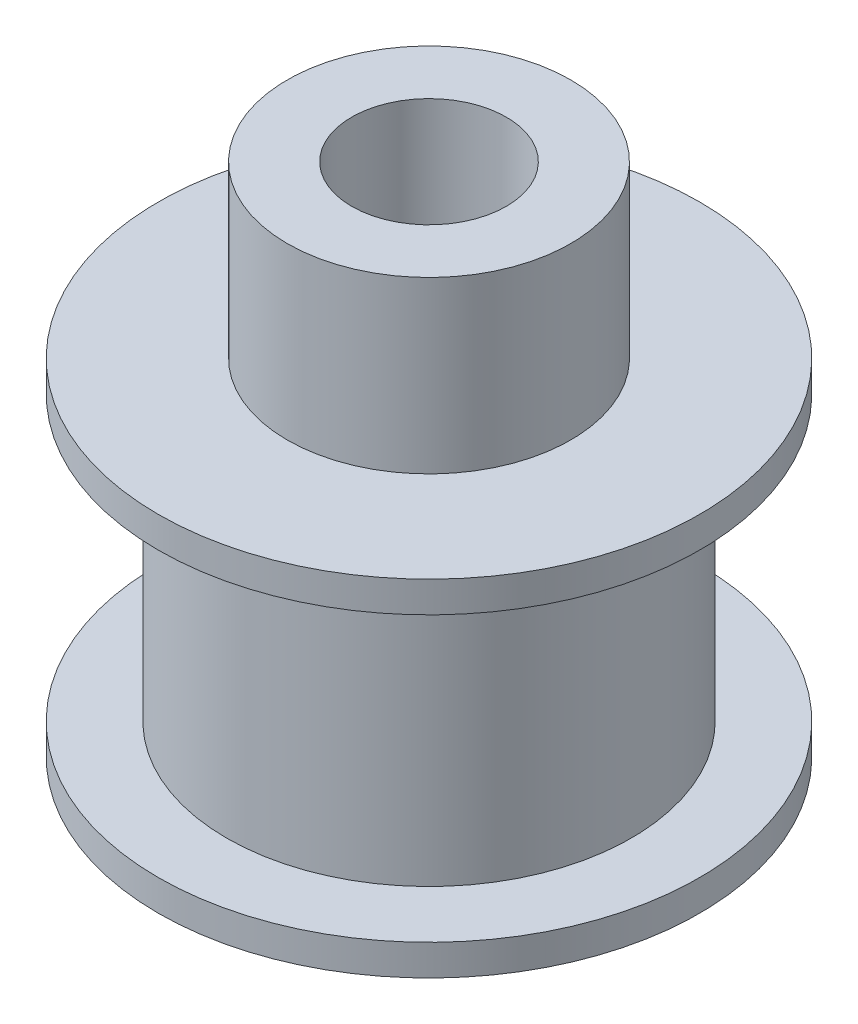
ISO-10303-21;
HEADER;
FILE_DESCRIPTION(('STEP AP214'),'2;1');
FILE_NAME('part.step','',(''),(''),'','','');
FILE_SCHEMA(('AUTOMOTIVE_DESIGN { 1 0 10303 214 1 1 1 1 }'));
ENDSEC;
DATA;
#1=APPLICATION_CONTEXT('core data for automotive mechanical design processes');
#2=APPLICATION_PROTOCOL_DEFINITION('international standard','automotive_design',2000,#1);
#3=PRODUCT_CONTEXT('',#1,'mechanical');
#4=PRODUCT('Part','Part','',(#3));
#5=PRODUCT_RELATED_PRODUCT_CATEGORY('part','',(#4));
#6=PRODUCT_DEFINITION_FORMATION('','',#4);
#7=PRODUCT_DEFINITION_CONTEXT('part definition',#1,'design');
#8=PRODUCT_DEFINITION('design','',#6,#7);
#9=PRODUCT_DEFINITION_SHAPE('','',#8);
#10=(LENGTH_UNIT() NAMED_UNIT(*) SI_UNIT(.MILLI.,.METRE.));
#11=(NAMED_UNIT(*) PLANE_ANGLE_UNIT() SI_UNIT($,.RADIAN.));
#12=(NAMED_UNIT(*) SI_UNIT($,.STERADIAN.) SOLID_ANGLE_UNIT());
#13=UNCERTAINTY_MEASURE_WITH_UNIT(LENGTH_MEASURE(1.E-05),#10,'distance_accuracy_value','');
#14=(GEOMETRIC_REPRESENTATION_CONTEXT(3) GLOBAL_UNCERTAINTY_ASSIGNED_CONTEXT((#13)) GLOBAL_UNIT_ASSIGNED_CONTEXT((#10,
#11,#12)) REPRESENTATION_CONTEXT('',''));
#15=CARTESIAN_POINT('',(0.,0.,0.));
#16=DIRECTION('',(0.,0.,1.));
#17=DIRECTION('',(1.,0.,0.));
#18=AXIS2_PLACEMENT_3D('',#15,#16,#17);
#19=CARTESIAN_POINT('',(0.,1.2,0.));
#20=DIRECTION('',(0.,-1.,0.));
#21=DIRECTION('',(0.,0.,-1.));
#22=AXIS2_PLACEMENT_3D('',#19,#20,#21);
#23=CYLINDRICAL_SURFACE('',#22,10.5);
#24=CARTESIAN_POINT('',(0.,1.2,0.));
#25=DIRECTION('',(0.,1.,0.));
#26=DIRECTION('',(0.,0.,1.));
#27=AXIS2_PLACEMENT_3D('',#24,#25,#26);
#28=CIRCLE('',#27,10.5);
#29=CARTESIAN_POINT('',(0.,1.2,10.5));
#30=VERTEX_POINT('',#29);
#31=EDGE_CURVE('E10',#30,#30,#28,.T.);
#32=ORIENTED_EDGE('',*,*,#31,.F.);
#33=EDGE_LOOP('',(#32));
#34=FACE_BOUND('',#33,.T.);
#35=CARTESIAN_POINT('',(0.,0.,0.));
#36=DIRECTION('',(0.,1.,0.));
#37=DIRECTION('',(0.,0.,1.));
#38=AXIS2_PLACEMENT_3D('',#35,#36,#37);
#39=CIRCLE('',#38,10.5);
#40=CARTESIAN_POINT('',(0.,0.,10.5));
#41=VERTEX_POINT('',#40);
#42=EDGE_CURVE('E36',#41,#41,#39,.T.);
#43=ORIENTED_EDGE('',*,*,#42,.T.);
#44=EDGE_LOOP('',(#43));
#45=FACE_BOUND('',#44,.T.);
#46=ADVANCED_FACE('F33',(#34,#45),#23,.T.);
#47=CARTESIAN_POINT('',(0.,1.2,0.));
#48=DIRECTION('',(0.,1.,0.));
#49=DIRECTION('',(0.,0.,1.));
#50=AXIS2_PLACEMENT_3D('',#47,#48,#49);
#51=PLANE('',#50);
#52=CARTESIAN_POINT('',(0.,1.2,0.));
#53=DIRECTION('',(0.,1.,0.));
#54=DIRECTION('',(0.,0.,1.));
#55=AXIS2_PLACEMENT_3D('',#52,#53,#54);
#56=CIRCLE('',#55,7.85);
#57=CARTESIAN_POINT('',(0.,1.2,7.85));
#58=VERTEX_POINT('',#57);
#59=EDGE_CURVE('E45',#58,#58,#56,.T.);
#60=ORIENTED_EDGE('',*,*,#59,.F.);
#61=EDGE_LOOP('',(#60));
#62=FACE_BOUND('',#61,.T.);
#63=ORIENTED_EDGE('',*,*,#31,.T.);
#64=EDGE_LOOP('',(#63));
#65=FACE_BOUND('',#64,.T.);
#66=ADVANCED_FACE('F110',(#62,#65),#51,.T.);
#67=CARTESIAN_POINT('',(0.,0.,0.));
#68=DIRECTION('',(0.,1.,0.));
#69=DIRECTION('',(0.,0.,1.));
#70=AXIS2_PLACEMENT_3D('',#67,#68,#69);
#71=PLANE('',#70);
#72=CARTESIAN_POINT('',(0.,0.,0.));
#73=DIRECTION('',(0.,1.,0.));
#74=DIRECTION('',(0.,0.,1.));
#75=AXIS2_PLACEMENT_3D('',#72,#73,#74);
#76=CIRCLE('',#75,3.);
#77=CARTESIAN_POINT('',(0.,0.,3.));
#78=VERTEX_POINT('',#77);
#79=EDGE_CURVE('E60',#78,#78,#76,.T.);
#80=ORIENTED_EDGE('',*,*,#79,.T.);
#81=EDGE_LOOP('',(#80));
#82=FACE_BOUND('',#81,.T.);
#83=ORIENTED_EDGE('',*,*,#42,.F.);
#84=EDGE_LOOP('',(#83));
#85=FACE_BOUND('',#84,.T.);
#86=ADVANCED_FACE('F69',(#82,#85),#71,.F.);
#87=CARTESIAN_POINT('',(0.,12.2,0.));
#88=DIRECTION('',(0.,-1.,0.));
#89=DIRECTION('',(0.,0.,-1.));
#90=AXIS2_PLACEMENT_3D('',#87,#88,#89);
#91=CYLINDRICAL_SURFACE('',#90,7.85);
#92=CARTESIAN_POINT('',(0.,12.2,0.));
#93=DIRECTION('',(0.,1.,0.));
#94=DIRECTION('',(0.,0.,1.));
#95=AXIS2_PLACEMENT_3D('',#92,#93,#94);
#96=CIRCLE('',#95,7.85);
#97=CARTESIAN_POINT('',(0.,12.2,7.85));
#98=VERTEX_POINT('',#97);
#99=EDGE_CURVE('E43',#98,#98,#96,.T.);
#100=ORIENTED_EDGE('',*,*,#99,.F.);
#101=EDGE_LOOP('',(#100));
#102=FACE_BOUND('',#101,.T.);
#103=ORIENTED_EDGE('',*,*,#59,.T.);
#104=EDGE_LOOP('',(#103));
#105=FACE_BOUND('',#104,.T.);
#106=ADVANCED_FACE('F100',(#102,#105),#91,.T.);
#107=CARTESIAN_POINT('',(0.,13.4,0.));
#108=DIRECTION('',(0.,-1.,0.));
#109=DIRECTION('',(0.,0.,-1.));
#110=AXIS2_PLACEMENT_3D('',#107,#108,#109);
#111=CYLINDRICAL_SURFACE('',#110,10.5);
#112=CARTESIAN_POINT('',(0.,13.4,0.));
#113=DIRECTION('',(0.,1.,0.));
#114=DIRECTION('',(0.,0.,1.));
#115=AXIS2_PLACEMENT_3D('',#112,#113,#114);
#116=CIRCLE('',#115,10.5);
#117=CARTESIAN_POINT('',(0.,13.4,10.5));
#118=VERTEX_POINT('',#117);
#119=EDGE_CURVE('E48',#118,#118,#116,.T.);
#120=ORIENTED_EDGE('',*,*,#119,.F.);
#121=EDGE_LOOP('',(#120));
#122=FACE_BOUND('',#121,.T.);
#123=CARTESIAN_POINT('',(0.,12.2,0.));
#124=DIRECTION('',(0.,1.,0.));
#125=DIRECTION('',(0.,0.,1.));
#126=AXIS2_PLACEMENT_3D('',#123,#124,#125);
#127=CIRCLE('',#126,10.5);
#128=CARTESIAN_POINT('',(0.,12.2,10.5));
#129=VERTEX_POINT('',#128);
#130=EDGE_CURVE('E51',#129,#129,#127,.T.);
#131=ORIENTED_EDGE('',*,*,#130,.T.);
#132=EDGE_LOOP('',(#131));
#133=FACE_BOUND('',#132,.T.);
#134=ADVANCED_FACE('F94',(#122,#133),#111,.T.);
#135=CARTESIAN_POINT('',(0.,13.4,0.));
#136=DIRECTION('',(0.,1.,0.));
#137=DIRECTION('',(0.,0.,1.));
#138=AXIS2_PLACEMENT_3D('',#135,#136,#137);
#139=PLANE('',#138);
#140=CARTESIAN_POINT('',(0.,13.4,0.));
#141=DIRECTION('',(0.,1.,0.));
#142=DIRECTION('',(0.,0.,1.));
#143=AXIS2_PLACEMENT_3D('',#140,#141,#142);
#144=CIRCLE('',#143,5.5);
#145=CARTESIAN_POINT('',(0.,13.4,5.5));
#146=VERTEX_POINT('',#145);
#147=EDGE_CURVE('E57',#146,#146,#144,.T.);
#148=ORIENTED_EDGE('',*,*,#147,.F.);
#149=EDGE_LOOP('',(#148));
#150=FACE_BOUND('',#149,.T.);
#151=ORIENTED_EDGE('',*,*,#119,.T.);
#152=EDGE_LOOP('',(#151));
#153=FACE_BOUND('',#152,.T.);
#154=ADVANCED_FACE('F91',(#150,#153),#139,.T.);
#155=CARTESIAN_POINT('',(0.,12.2,0.));
#156=DIRECTION('',(0.,1.,0.));
#157=DIRECTION('',(0.,0.,1.));
#158=AXIS2_PLACEMENT_3D('',#155,#156,#157);
#159=PLANE('',#158);
#160=ORIENTED_EDGE('',*,*,#99,.T.);
#161=EDGE_LOOP('',(#160));
#162=FACE_BOUND('',#161,.T.);
#163=ORIENTED_EDGE('',*,*,#130,.F.);
#164=EDGE_LOOP('',(#163));
#165=FACE_BOUND('',#164,.T.);
#166=ADVANCED_FACE('F87',(#162,#165),#159,.F.);
#167=CARTESIAN_POINT('',(0.,20.,0.));
#168=DIRECTION('',(0.,-1.,0.));
#169=DIRECTION('',(0.,0.,-1.));
#170=AXIS2_PLACEMENT_3D('',#167,#168,#169);
#171=CYLINDRICAL_SURFACE('',#170,5.5);
#172=CARTESIAN_POINT('',(0.,20.,0.));
#173=DIRECTION('',(0.,1.,0.));
#174=DIRECTION('',(0.,0.,1.));
#175=AXIS2_PLACEMENT_3D('',#172,#173,#174);
#176=CIRCLE('',#175,5.5);
#177=CARTESIAN_POINT('',(0.,20.,5.5));
#178=VERTEX_POINT('',#177);
#179=EDGE_CURVE('E54',#178,#178,#176,.T.);
#180=ORIENTED_EDGE('',*,*,#179,.F.);
#181=EDGE_LOOP('',(#180));
#182=FACE_BOUND('',#181,.T.);
#183=ORIENTED_EDGE('',*,*,#147,.T.);
#184=EDGE_LOOP('',(#183));
#185=FACE_BOUND('',#184,.T.);
#186=ADVANCED_FACE('F81',(#182,#185),#171,.T.);
#187=CARTESIAN_POINT('',(0.,20.,0.));
#188=DIRECTION('',(0.,1.,0.));
#189=DIRECTION('',(0.,0.,1.));
#190=AXIS2_PLACEMENT_3D('',#187,#188,#189);
#191=PLANE('',#190);
#192=CARTESIAN_POINT('',(0.,20.,0.));
#193=DIRECTION('',(0.,1.,0.));
#194=DIRECTION('',(0.,0.,1.));
#195=AXIS2_PLACEMENT_3D('',#192,#193,#194);
#196=CIRCLE('',#195,3.);
#197=CARTESIAN_POINT('',(0.,20.,3.));
#198=VERTEX_POINT('',#197);
#199=EDGE_CURVE('E63',#198,#198,#196,.T.);
#200=ORIENTED_EDGE('',*,*,#199,.F.);
#201=EDGE_LOOP('',(#200));
#202=FACE_BOUND('',#201,.T.);
#203=ORIENTED_EDGE('',*,*,#179,.T.);
#204=EDGE_LOOP('',(#203));
#205=FACE_BOUND('',#204,.T.);
#206=ADVANCED_FACE('F75',(#202,#205),#191,.T.);
#207=CARTESIAN_POINT('',(0.,0.,0.));
#208=DIRECTION('',(0.,1.,0.));
#209=DIRECTION('',(0.,0.,1.));
#210=AXIS2_PLACEMENT_3D('',#207,#208,#209);
#211=CYLINDRICAL_SURFACE('',#210,3.);
#212=ORIENTED_EDGE('',*,*,#79,.F.);
#213=EDGE_LOOP('',(#212));
#214=FACE_BOUND('',#213,.T.);
#215=ORIENTED_EDGE('',*,*,#199,.T.);
#216=EDGE_LOOP('',(#215));
#217=FACE_BOUND('',#216,.T.);
#218=ADVANCED_FACE('F72',(#214,#217),#211,.F.);
#219=CLOSED_SHELL('',(#46,#66,#86,#106,#134,#154,#166,#186,#206,#218));
#220=MANIFOLD_SOLID_BREP('B2',#219);
#221=ADVANCED_BREP_SHAPE_REPRESENTATION('',(#18,#220),#14);
#222=SHAPE_DEFINITION_REPRESENTATION(#9,#221);
ENDSEC;
END-ISO-10303-21;
